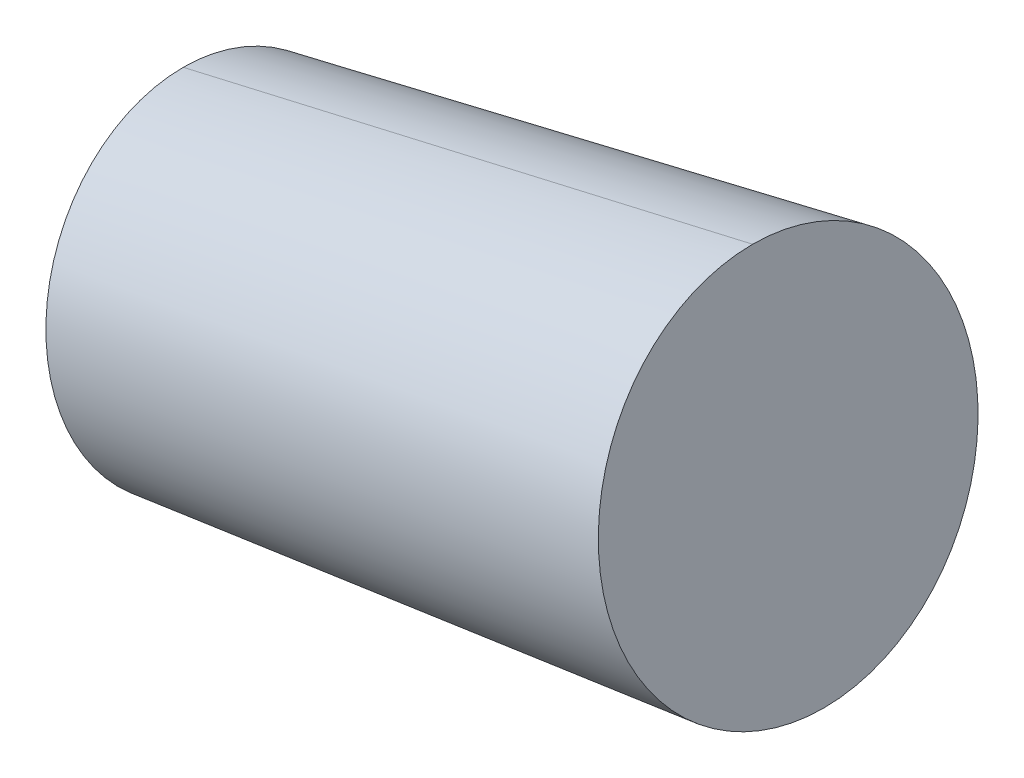
ISO-10303-21;
HEADER;
FILE_DESCRIPTION(('STEP AP214'),'2;1');
FILE_NAME('part.step','',(''),(''),'','','');
FILE_SCHEMA(('AUTOMOTIVE_DESIGN { 1 0 10303 214 1 1 1 1 }'));
ENDSEC;
DATA;
#1=APPLICATION_CONTEXT('core data for automotive mechanical design processes');
#2=APPLICATION_PROTOCOL_DEFINITION('international standard','automotive_design',2000,#1);
#3=PRODUCT_CONTEXT('',#1,'mechanical');
#4=PRODUCT('Part','Part','',(#3));
#5=PRODUCT_RELATED_PRODUCT_CATEGORY('part','',(#4));
#6=PRODUCT_DEFINITION_FORMATION('','',#4);
#7=PRODUCT_DEFINITION_CONTEXT('part definition',#1,'design');
#8=PRODUCT_DEFINITION('design','',#6,#7);
#9=PRODUCT_DEFINITION_SHAPE('','',#8);
#10=(LENGTH_UNIT() NAMED_UNIT(*) SI_UNIT(.MILLI.,.METRE.));
#11=(NAMED_UNIT(*) PLANE_ANGLE_UNIT() SI_UNIT($,.RADIAN.));
#12=(NAMED_UNIT(*) SI_UNIT($,.STERADIAN.) SOLID_ANGLE_UNIT());
#13=UNCERTAINTY_MEASURE_WITH_UNIT(LENGTH_MEASURE(1.E-05),#10,'distance_accuracy_value','');
#14=(GEOMETRIC_REPRESENTATION_CONTEXT(3) GLOBAL_UNCERTAINTY_ASSIGNED_CONTEXT((#13)) GLOBAL_UNIT_ASSIGNED_CONTEXT((#10,
#11,#12)) REPRESENTATION_CONTEXT('',''));
#15=CARTESIAN_POINT('',(0.,0.,0.));
#16=DIRECTION('',(0.,0.,1.));
#17=DIRECTION('',(1.,0.,0.));
#18=AXIS2_PLACEMENT_3D('',#15,#16,#17);
#19=CARTESIAN_POINT('',(9.13352986772703,13.33320898794,0.));
#20=DIRECTION('',(-0.981647159536542,-0.190706198572144,0.));
#21=DIRECTION('',(0.190706198572144,-0.981647159536542,0.));
#22=AXIS2_PLACEMENT_3D('',#19,#20,#21);
#23=PLANE('',#22);
#24=CARTESIAN_POINT('',(9.13352986772717,13.33320898794,0.));
#25=DIRECTION('',(-0.981647159536542,-0.190706198572144,0.));
#26=DIRECTION('',(0.190706198572144,-0.981647159536542,0.));
#27=AXIS2_PLACEMENT_3D('',#24,#25,#26);
#28=CIRCLE('',#27,2.42190294511065);
#29=CARTESIAN_POINT('',(8.67165796375444,15.7106631346811,0.));
#30=VERTEX_POINT('',#29);
#31=CARTESIAN_POINT('',(9.5954017716999,10.955754841199,0.));
#32=VERTEX_POINT('',#31);
#33=EDGE_CURVE('E11',#30,#32,#28,.T.);
#34=ORIENTED_EDGE('',*,*,#33,.F.);
#35=CARTESIAN_POINT('',(9.13352986772717,13.33320898794,0.));
#36=DIRECTION('',(-0.981647159536542,-0.190706198572144,0.));
#37=DIRECTION('',(0.190706198572144,-0.981647159536542,0.));
#38=AXIS2_PLACEMENT_3D('',#35,#36,#37);
#39=CIRCLE('',#38,2.42190294511065);
#40=EDGE_CURVE('E25',#32,#30,#39,.T.);
#41=ORIENTED_EDGE('',*,*,#40,.F.);
#42=EDGE_LOOP('',(#34,#41));
#43=FACE_BOUND('',#42,.T.);
#44=ADVANCED_FACE('F17',(#43),#23,.F.);
#45=CARTESIAN_POINT('',(9.13352986772717,13.33320898794,0.));
#46=DIRECTION('',(0.981647159536542,0.190706198572144,0.));
#47=DIRECTION('',(0.,0.,-1.));
#48=AXIS2_PLACEMENT_3D('',#45,#46,#47);
#49=CONICAL_SURFACE('',#48,2.42190294511065,0.0350113047948827);
#50=DIRECTION('',(0.987721082490207,0.156227600648458,0.));
#51=VECTOR('',#50,1.);
#52=CARTESIAN_POINT('',(2.1006162076405,9.77030645217028,0.));
#53=LINE('',#52,#51);
#54=CARTESIAN_POINT('',(2.1006162076405,9.77030645217028,0.));
#55=VERTEX_POINT('',#54);
#56=EDGE_CURVE('E43',#55,#32,#53,.T.);
#57=ORIENTED_EDGE('',*,*,#56,.T.);
#58=ORIENTED_EDGE('',*,*,#40,.T.);
#59=DIRECTION('',(0.974370064785284,0.224951054343654,0.));
#60=VECTOR('',#59,1.);
#61=CARTESIAN_POINT('',(1.27817935419284,14.0037441019678,0.));
#62=LINE('',#61,#60);
#63=CARTESIAN_POINT('',(1.27817935419284,14.0037441019678,0.));
#64=VERTEX_POINT('',#63);
#65=EDGE_CURVE('E45',#64,#30,#62,.T.);
#66=ORIENTED_EDGE('',*,*,#65,.F.);
#67=CARTESIAN_POINT('',(1.68939778091667,11.887025277069,0.));
#68=DIRECTION('',(-0.981647159536542,-0.190706198572144,0.));
#69=DIRECTION('',(0.190706198572144,-0.981647159536542,0.));
#70=AXIS2_PLACEMENT_3D('',#67,#68,#69);
#71=CIRCLE('',#70,2.15629292494269);
#72=EDGE_CURVE('E40',#55,#64,#71,.T.);
#73=ORIENTED_EDGE('',*,*,#72,.F.);
#74=EDGE_LOOP('',(#57,#58,#66,#73));
#75=FACE_BOUND('',#74,.T.);
#76=ADVANCED_FACE('F42',(#75),#49,.T.);
#77=CARTESIAN_POINT('',(2.10061620764041,9.77030645217028,0.));
#78=DIRECTION('',(0.981647159536542,0.190706198572144,0.));
#79=DIRECTION('',(-0.190706198572144,0.981647159536542,0.));
#80=AXIS2_PLACEMENT_3D('',#77,#78,#79);
#81=PLANE('',#80);
#82=ORIENTED_EDGE('',*,*,#72,.T.);
#83=CARTESIAN_POINT('',(1.68939778091667,11.887025277069,0.));
#84=DIRECTION('',(-0.981647159536542,-0.190706198572144,0.));
#85=DIRECTION('',(0.190706198572144,-0.981647159536542,0.));
#86=AXIS2_PLACEMENT_3D('',#83,#84,#85);
#87=CIRCLE('',#86,2.15629292494269);
#88=EDGE_CURVE('E49',#64,#55,#87,.T.);
#89=ORIENTED_EDGE('',*,*,#88,.T.);
#90=EDGE_LOOP('',(#82,#89));
#91=FACE_BOUND('',#90,.T.);
#92=ADVANCED_FACE('F54',(#91),#81,.F.);
#93=CARTESIAN_POINT('',(9.13352986772717,13.33320898794,0.));
#94=DIRECTION('',(0.981647159536542,0.190706198572144,0.));
#95=DIRECTION('',(0.,0.,1.));
#96=AXIS2_PLACEMENT_3D('',#93,#94,#95);
#97=CONICAL_SURFACE('',#96,2.42190294511065,0.0350113047948827);
#98=ORIENTED_EDGE('',*,*,#56,.F.);
#99=ORIENTED_EDGE('',*,*,#88,.F.);
#100=ORIENTED_EDGE('',*,*,#65,.T.);
#101=ORIENTED_EDGE('',*,*,#33,.T.);
#102=EDGE_LOOP('',(#98,#99,#100,#101));
#103=FACE_BOUND('',#102,.T.);
#104=ADVANCED_FACE('F52',(#103),#97,.T.);
#105=CLOSED_SHELL('',(#44,#76,#92,#104));
#106=MANIFOLD_SOLID_BREP('B1',#105);
#107=ADVANCED_BREP_SHAPE_REPRESENTATION('',(#18,#106),#14);
#108=SHAPE_DEFINITION_REPRESENTATION(#9,#107);
ENDSEC;
END-ISO-10303-21;
